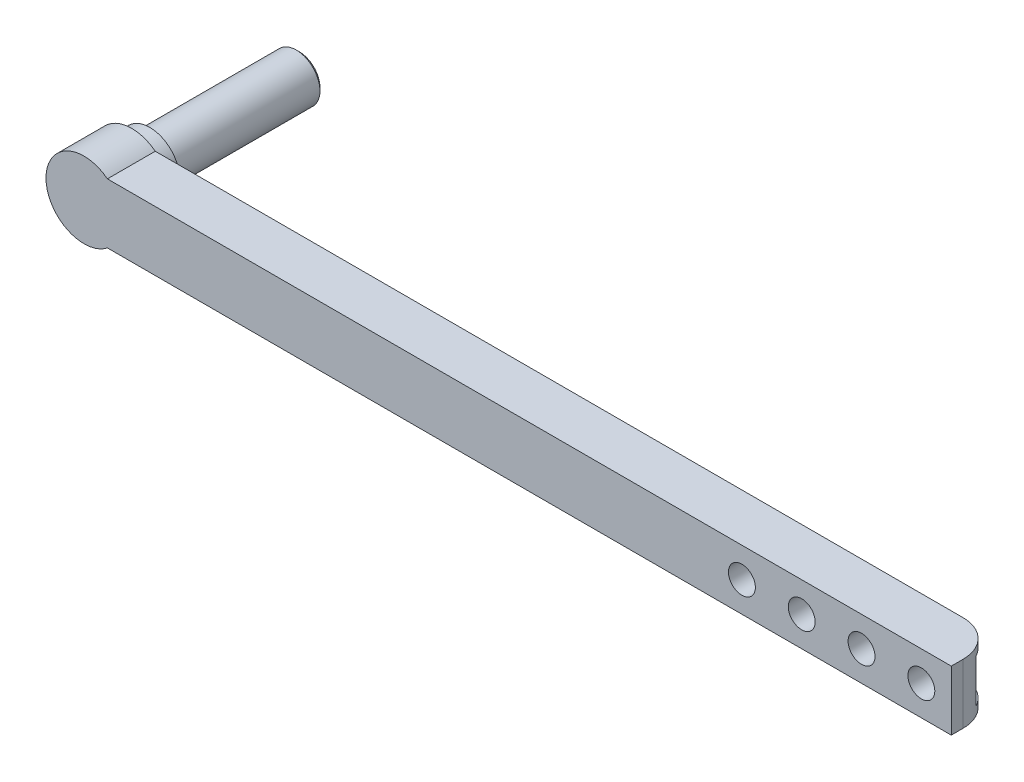
ISO-10303-21;
HEADER;
FILE_DESCRIPTION(('STEP AP214'),'2;1');
FILE_NAME('part.step','',(''),(''),'','','');
FILE_SCHEMA(('AUTOMOTIVE_DESIGN { 1 0 10303 214 1 1 1 1 }'));
ENDSEC;
DATA;
#1=APPLICATION_CONTEXT('core data for automotive mechanical design processes');
#2=APPLICATION_PROTOCOL_DEFINITION('international standard','automotive_design',2000,#1);
#3=PRODUCT_CONTEXT('',#1,'mechanical');
#4=PRODUCT('Part','Part','',(#3));
#5=PRODUCT_RELATED_PRODUCT_CATEGORY('part','',(#4));
#6=PRODUCT_DEFINITION_FORMATION('','',#4);
#7=PRODUCT_DEFINITION_CONTEXT('part definition',#1,'design');
#8=PRODUCT_DEFINITION('design','',#6,#7);
#9=PRODUCT_DEFINITION_SHAPE('','',#8);
#10=(LENGTH_UNIT() NAMED_UNIT(*) SI_UNIT(.MILLI.,.METRE.));
#11=(NAMED_UNIT(*) PLANE_ANGLE_UNIT() SI_UNIT($,.RADIAN.));
#12=(NAMED_UNIT(*) SI_UNIT($,.STERADIAN.) SOLID_ANGLE_UNIT());
#13=UNCERTAINTY_MEASURE_WITH_UNIT(LENGTH_MEASURE(1.E-05),#10,'distance_accuracy_value','');
#14=(GEOMETRIC_REPRESENTATION_CONTEXT(3) GLOBAL_UNCERTAINTY_ASSIGNED_CONTEXT((#13)) GLOBAL_UNIT_ASSIGNED_CONTEXT((#10,
#11,#12)) REPRESENTATION_CONTEXT('',''));
#15=CARTESIAN_POINT('',(0.,0.,0.));
#16=DIRECTION('',(0.,0.,1.));
#17=DIRECTION('',(1.,0.,0.));
#18=AXIS2_PLACEMENT_3D('',#15,#16,#17);
#19=CARTESIAN_POINT('',(0.,0.,8.));
#20=DIRECTION('',(0.,0.,-1.));
#21=DIRECTION('',(-1.,0.,0.));
#22=AXIS2_PLACEMENT_3D('',#19,#20,#21);
#23=CYLINDRICAL_SURFACE('',#22,6.35);
#24=CARTESIAN_POINT('',(0.,0.,0.));
#25=DIRECTION('',(0.,0.,1.));
#26=DIRECTION('',(1.,0.,0.));
#27=AXIS2_PLACEMENT_3D('',#24,#25,#26);
#28=CIRCLE('',#27,6.35);
#29=CARTESIAN_POINT('',(3.91439650520997,5.,0.));
#30=VERTEX_POINT('',#29);
#31=CARTESIAN_POINT('',(3.91439650520997,-5.,0.));
#32=VERTEX_POINT('',#31);
#33=EDGE_CURVE('E141',#30,#32,#28,.T.);
#34=ORIENTED_EDGE('',*,*,#33,.T.);
#35=DIRECTION('',(0.,0.,-1.));
#36=VECTOR('',#35,1.);
#37=CARTESIAN_POINT('',(3.91439650520997,-5.,8.));
#38=LINE('',#37,#36);
#39=CARTESIAN_POINT('',(3.91439650520997,-5.,8.));
#40=VERTEX_POINT('',#39);
#41=EDGE_CURVE('E139',#40,#32,#38,.T.);
#42=ORIENTED_EDGE('',*,*,#41,.F.);
#43=CARTESIAN_POINT('',(0.,0.,8.));
#44=DIRECTION('',(0.,0.,1.));
#45=DIRECTION('',(1.,0.,0.));
#46=AXIS2_PLACEMENT_3D('',#43,#44,#45);
#47=CIRCLE('',#46,6.35);
#48=CARTESIAN_POINT('',(3.91439650520997,5.,8.));
#49=VERTEX_POINT('',#48);
#50=EDGE_CURVE('E123',#49,#40,#47,.T.);
#51=ORIENTED_EDGE('',*,*,#50,.F.);
#52=DIRECTION('',(0.,0.,-1.));
#53=VECTOR('',#52,1.);
#54=CARTESIAN_POINT('',(3.91439650520997,5.,8.));
#55=LINE('',#54,#53);
#56=EDGE_CURVE('E156',#49,#30,#55,.T.);
#57=ORIENTED_EDGE('',*,*,#56,.T.);
#58=EDGE_LOOP('',(#34,#42,#51,#57));
#59=FACE_BOUND('',#58,.T.);
#60=ADVANCED_FACE('F45',(#59),#23,.T.);
#61=CARTESIAN_POINT('',(0.,-5.,8.));
#62=DIRECTION('',(0.,-1.,0.));
#63=DIRECTION('',(0.,0.,-1.));
#64=AXIS2_PLACEMENT_3D('',#61,#62,#63);
#65=PLANE('',#64);
#66=DIRECTION('',(-1.,0.,0.));
#67=VECTOR('',#66,1.);
#68=CARTESIAN_POINT('',(0.,-5.,0.));
#69=LINE('',#68,#67);
#70=CARTESIAN_POINT('',(139.,-5.,0.));
#71=VERTEX_POINT('',#70);
#72=EDGE_CURVE('E158',#71,#32,#69,.T.);
#73=ORIENTED_EDGE('',*,*,#72,.F.);
#74=CARTESIAN_POINT('',(139.,-5.,6.));
#75=DIRECTION('',(0.,-1.,0.));
#76=DIRECTION('',(0.,0.,-1.));
#77=AXIS2_PLACEMENT_3D('',#74,#75,#76);
#78=CIRCLE('',#77,6.);
#79=CARTESIAN_POINT('',(145.,-5.,6.));
#80=VERTEX_POINT('',#79);
#81=EDGE_CURVE('E209',#71,#80,#78,.T.);
#82=ORIENTED_EDGE('',*,*,#81,.T.);
#83=DIRECTION('',(0.,0.,-1.));
#84=VECTOR('',#83,1.);
#85=CARTESIAN_POINT('',(145.,-5.,8.));
#86=LINE('',#85,#84);
#87=CARTESIAN_POINT('',(145.,-5.,8.));
#88=VERTEX_POINT('',#87);
#89=EDGE_CURVE('E145',#88,#80,#86,.T.);
#90=ORIENTED_EDGE('',*,*,#89,.F.);
#91=DIRECTION('',(-1.,0.,0.));
#92=VECTOR('',#91,1.);
#93=CARTESIAN_POINT('',(0.,-5.,8.));
#94=LINE('',#93,#92);
#95=EDGE_CURVE('E128',#88,#40,#94,.T.);
#96=ORIENTED_EDGE('',*,*,#95,.T.);
#97=ORIENTED_EDGE('',*,*,#41,.T.);
#98=EDGE_LOOP('',(#73,#82,#90,#96,#97));
#99=FACE_BOUND('',#98,.T.);
#100=ADVANCED_FACE('F147',(#99),#65,.T.);
#101=CARTESIAN_POINT('',(145.,0.,8.));
#102=DIRECTION('',(1.,0.,0.));
#103=DIRECTION('',(0.,0.,-1.));
#104=AXIS2_PLACEMENT_3D('',#101,#102,#103);
#105=PLANE('',#104);
#106=ORIENTED_EDGE('',*,*,#89,.T.);
#107=DIRECTION('',(0.,-1.,0.));
#108=VECTOR('',#107,1.);
#109=CARTESIAN_POINT('',(145.,5.,6.));
#110=LINE('',#109,#108);
#111=CARTESIAN_POINT('',(145.,5.,6.));
#112=VERTEX_POINT('',#111);
#113=EDGE_CURVE('E211',#80,#112,#110,.F.);
#114=ORIENTED_EDGE('',*,*,#113,.T.);
#115=DIRECTION('',(0.,0.,-1.));
#116=VECTOR('',#115,1.);
#117=CARTESIAN_POINT('',(145.,5.,8.));
#118=LINE('',#117,#116);
#119=CARTESIAN_POINT('',(145.,5.,8.));
#120=VERTEX_POINT('',#119);
#121=EDGE_CURVE('E163',#120,#112,#118,.T.);
#122=ORIENTED_EDGE('',*,*,#121,.F.);
#123=DIRECTION('',(0.,-1.,0.));
#124=VECTOR('',#123,1.);
#125=CARTESIAN_POINT('',(145.,0.,8.));
#126=LINE('',#125,#124);
#127=EDGE_CURVE('E150',#120,#88,#126,.T.);
#128=ORIENTED_EDGE('',*,*,#127,.T.);
#129=EDGE_LOOP('',(#106,#114,#122,#128));
#130=FACE_BOUND('',#129,.T.);
#131=ADVANCED_FACE('F232',(#130),#105,.T.);
#132=CARTESIAN_POINT('',(0.,5.,8.));
#133=DIRECTION('',(0.,-1.,0.));
#134=DIRECTION('',(0.,0.,-1.));
#135=AXIS2_PLACEMENT_3D('',#132,#133,#134);
#136=PLANE('',#135);
#137=ORIENTED_EDGE('',*,*,#121,.T.);
#138=CARTESIAN_POINT('',(139.,5.,6.));
#139=DIRECTION('',(0.,-1.,0.));
#140=DIRECTION('',(0.,0.,-1.));
#141=AXIS2_PLACEMENT_3D('',#138,#139,#140);
#142=CIRCLE('',#141,6.);
#143=CARTESIAN_POINT('',(139.,5.,0.));
#144=VERTEX_POINT('',#143);
#145=EDGE_CURVE('E11',#112,#144,#142,.F.);
#146=ORIENTED_EDGE('',*,*,#145,.T.);
#147=DIRECTION('',(-1.,0.,0.));
#148=VECTOR('',#147,1.);
#149=CARTESIAN_POINT('',(0.,5.,0.));
#150=LINE('',#149,#148);
#151=EDGE_CURVE('E135',#144,#30,#150,.T.);
#152=ORIENTED_EDGE('',*,*,#151,.T.);
#153=ORIENTED_EDGE('',*,*,#56,.F.);
#154=DIRECTION('',(-1.,0.,0.));
#155=VECTOR('',#154,1.);
#156=CARTESIAN_POINT('',(0.,5.,8.));
#157=LINE('',#156,#155);
#158=EDGE_CURVE('E131',#120,#49,#157,.T.);
#159=ORIENTED_EDGE('',*,*,#158,.F.);
#160=EDGE_LOOP('',(#137,#146,#152,#153,#159));
#161=FACE_BOUND('',#160,.T.);
#162=ADVANCED_FACE('F234',(#161),#136,.F.);
#163=CARTESIAN_POINT('',(0.,0.,8.));
#164=DIRECTION('',(0.,0.,1.));
#165=DIRECTION('',(1.,0.,0.));
#166=AXIS2_PLACEMENT_3D('',#163,#164,#165);
#167=PLANE('',#166);
#168=CARTESIAN_POINT('',(140.,0.,8.));
#169=DIRECTION('',(0.,0.,1.));
#170=DIRECTION('',(1.,0.,0.));
#171=AXIS2_PLACEMENT_3D('',#168,#169,#170);
#172=CIRCLE('',#171,2.25);
#173=CARTESIAN_POINT('',(142.25,0.,8.));
#174=VERTEX_POINT('',#173);
#175=EDGE_CURVE('E182',#174,#174,#172,.T.);
#176=ORIENTED_EDGE('',*,*,#175,.F.);
#177=EDGE_LOOP('',(#176));
#178=FACE_BOUND('',#177,.T.);
#179=CARTESIAN_POINT('',(130.,0.,8.));
#180=DIRECTION('',(0.,0.,1.));
#181=DIRECTION('',(1.,0.,0.));
#182=AXIS2_PLACEMENT_3D('',#179,#180,#181);
#183=CIRCLE('',#182,2.25);
#184=CARTESIAN_POINT('',(132.25,0.,8.));
#185=VERTEX_POINT('',#184);
#186=EDGE_CURVE('E178',#185,#185,#183,.T.);
#187=ORIENTED_EDGE('',*,*,#186,.F.);
#188=EDGE_LOOP('',(#187));
#189=FACE_BOUND('',#188,.T.);
#190=CARTESIAN_POINT('',(120.,0.,8.));
#191=DIRECTION('',(0.,0.,1.));
#192=DIRECTION('',(1.,0.,0.));
#193=AXIS2_PLACEMENT_3D('',#190,#191,#192);
#194=CIRCLE('',#193,2.25);
#195=CARTESIAN_POINT('',(122.25,0.,8.));
#196=VERTEX_POINT('',#195);
#197=EDGE_CURVE('E174',#196,#196,#194,.T.);
#198=ORIENTED_EDGE('',*,*,#197,.F.);
#199=EDGE_LOOP('',(#198));
#200=FACE_BOUND('',#199,.T.);
#201=CARTESIAN_POINT('',(110.,0.,8.));
#202=DIRECTION('',(0.,0.,1.));
#203=DIRECTION('',(1.,0.,0.));
#204=AXIS2_PLACEMENT_3D('',#201,#202,#203);
#205=CIRCLE('',#204,2.25);
#206=CARTESIAN_POINT('',(112.25,0.,8.));
#207=VERTEX_POINT('',#206);
#208=EDGE_CURVE('E173',#207,#207,#205,.T.);
#209=ORIENTED_EDGE('',*,*,#208,.F.);
#210=EDGE_LOOP('',(#209));
#211=FACE_BOUND('',#210,.T.);
#212=ORIENTED_EDGE('',*,*,#50,.T.);
#213=ORIENTED_EDGE('',*,*,#95,.F.);
#214=ORIENTED_EDGE('',*,*,#127,.F.);
#215=ORIENTED_EDGE('',*,*,#158,.T.);
#216=EDGE_LOOP('',(#212,#213,#214,#215));
#217=FACE_BOUND('',#216,.T.);
#218=ADVANCED_FACE('F125',(#178,#189,#200,#211,#217),#167,.T.);
#219=CARTESIAN_POINT('',(0.,0.,0.));
#220=DIRECTION('',(0.,0.,1.));
#221=DIRECTION('',(1.,0.,0.));
#222=AXIS2_PLACEMENT_3D('',#219,#220,#221);
#223=PLANE('',#222);
#224=CARTESIAN_POINT('',(0.,0.,0.));
#225=DIRECTION('',(0.,0.,1.));
#226=DIRECTION('',(1.,0.,0.));
#227=AXIS2_PLACEMENT_3D('',#224,#225,#226);
#228=CIRCLE('',#227,5.);
#229=CARTESIAN_POINT('',(5.,0.,0.));
#230=VERTEX_POINT('',#229);
#231=EDGE_CURVE('E228',#230,#230,#228,.T.);
#232=ORIENTED_EDGE('',*,*,#231,.T.);
#233=EDGE_LOOP('',(#232));
#234=FACE_BOUND('',#233,.T.);
#235=DIRECTION('',(1.,0.,0.));
#236=VECTOR('',#235,1.);
#237=CARTESIAN_POINT('',(103.,-3.625,0.));
#238=LINE('',#237,#236);
#239=CARTESIAN_POINT('',(106.7,-3.625,0.));
#240=VERTEX_POINT('',#239);
#241=CARTESIAN_POINT('',(139.,-3.625,0.));
#242=VERTEX_POINT('',#241);
#243=EDGE_CURVE('E220',#240,#242,#238,.T.);
#244=ORIENTED_EDGE('',*,*,#243,.T.);
#245=DIRECTION('',(0.,-1.,0.));
#246=VECTOR('',#245,1.);
#247=CARTESIAN_POINT('',(139.,-5.,0.));
#248=LINE('',#247,#246);
#249=EDGE_CURVE('E206',#242,#71,#248,.T.);
#250=ORIENTED_EDGE('',*,*,#249,.T.);
#251=ORIENTED_EDGE('',*,*,#72,.T.);
#252=ORIENTED_EDGE('',*,*,#33,.F.);
#253=ORIENTED_EDGE('',*,*,#151,.F.);
#254=DIRECTION('',(0.,-1.,0.));
#255=VECTOR('',#254,1.);
#256=CARTESIAN_POINT('',(139.,3.625,0.));
#257=LINE('',#256,#255);
#258=CARTESIAN_POINT('',(139.,3.625,0.));
#259=VERTEX_POINT('',#258);
#260=EDGE_CURVE('E201',#144,#259,#257,.T.);
#261=ORIENTED_EDGE('',*,*,#260,.T.);
#262=DIRECTION('',(1.,0.,0.));
#263=VECTOR('',#262,1.);
#264=CARTESIAN_POINT('',(103.,3.625,0.));
#265=LINE('',#264,#263);
#266=CARTESIAN_POINT('',(106.7,3.625,0.));
#267=VERTEX_POINT('',#266);
#268=EDGE_CURVE('E238',#267,#259,#265,.T.);
#269=ORIENTED_EDGE('',*,*,#268,.F.);
#270=CARTESIAN_POINT('',(106.7,-0.0749999999999991,0.));
#271=DIRECTION('',(0.,0.,1.));
#272=DIRECTION('',(1.,0.,0.));
#273=AXIS2_PLACEMENT_3D('',#270,#271,#272);
#274=CIRCLE('',#273,3.7);
#275=CARTESIAN_POINT('',(103.000760213233,0.,0.));
#276=VERTEX_POINT('',#275);
#277=EDGE_CURVE('E199',#267,#276,#274,.T.);
#278=ORIENTED_EDGE('',*,*,#277,.T.);
#279=CARTESIAN_POINT('',(106.7,0.0749999999999991,0.));
#280=DIRECTION('',(0.,0.,1.));
#281=DIRECTION('',(1.,0.,0.));
#282=AXIS2_PLACEMENT_3D('',#279,#280,#281);
#283=CIRCLE('',#282,3.7);
#284=EDGE_CURVE('E197',#276,#240,#283,.T.);
#285=ORIENTED_EDGE('',*,*,#284,.T.);
#286=EDGE_LOOP('',(#244,#250,#251,#252,#253,#261,#269,#278,#285));
#287=FACE_BOUND('',#286,.T.);
#288=ADVANCED_FACE('F226',(#234,#287),#223,.F.);
#289=CARTESIAN_POINT('',(0.,0.,-3.));
#290=DIRECTION('',(0.,0.,1.));
#291=DIRECTION('',(1.,0.,0.));
#292=AXIS2_PLACEMENT_3D('',#289,#290,#291);
#293=CYLINDRICAL_SURFACE('',#292,5.);
#294=CARTESIAN_POINT('',(0.,0.,-3.));
#295=DIRECTION('',(0.,0.,1.));
#296=DIRECTION('',(1.,0.,0.));
#297=AXIS2_PLACEMENT_3D('',#294,#295,#296);
#298=CIRCLE('',#297,5.);
#299=CARTESIAN_POINT('',(5.,0.,-3.));
#300=VERTEX_POINT('',#299);
#301=EDGE_CURVE('E169',#300,#300,#298,.T.);
#302=ORIENTED_EDGE('',*,*,#301,.T.);
#303=EDGE_LOOP('',(#302));
#304=FACE_BOUND('',#303,.T.);
#305=ORIENTED_EDGE('',*,*,#231,.F.);
#306=EDGE_LOOP('',(#305));
#307=FACE_BOUND('',#306,.T.);
#308=ADVANCED_FACE('F255',(#304,#307),#293,.T.);
#309=CARTESIAN_POINT('',(0.,0.,-3.));
#310=DIRECTION('',(0.,0.,1.));
#311=DIRECTION('',(1.,0.,0.));
#312=AXIS2_PLACEMENT_3D('',#309,#310,#311);
#313=PLANE('',#312);
#314=CARTESIAN_POINT('',(0.,0.,-3.));
#315=DIRECTION('',(0.,0.,1.));
#316=DIRECTION('',(1.,0.,0.));
#317=AXIS2_PLACEMENT_3D('',#314,#315,#316);
#318=CIRCLE('',#317,3.95);
#319=CARTESIAN_POINT('',(3.95,0.,-3.));
#320=VERTEX_POINT('',#319);
#321=EDGE_CURVE('E159',#320,#320,#318,.F.);
#322=ORIENTED_EDGE('',*,*,#321,.F.);
#323=EDGE_LOOP('',(#322));
#324=FACE_BOUND('',#323,.T.);
#325=ORIENTED_EDGE('',*,*,#301,.F.);
#326=EDGE_LOOP('',(#325));
#327=FACE_BOUND('',#326,.T.);
#328=ADVANCED_FACE('F257',(#324,#327),#313,.F.);
#329=CARTESIAN_POINT('',(0.,0.,-28.));
#330=DIRECTION('',(0.,0.,1.));
#331=DIRECTION('',(1.,0.,0.));
#332=AXIS2_PLACEMENT_3D('',#329,#330,#331);
#333=PLANE('',#332);
#334=CARTESIAN_POINT('',(0.,0.,-28.));
#335=DIRECTION('',(0.,0.,1.));
#336=DIRECTION('',(1.,0.,0.));
#337=AXIS2_PLACEMENT_3D('',#334,#335,#336);
#338=CIRCLE('',#337,3.44999999999998);
#339=CARTESIAN_POINT('',(3.44999999999998,0.,-28.));
#340=VERTEX_POINT('',#339);
#341=EDGE_CURVE('E185',#340,#340,#338,.F.);
#342=ORIENTED_EDGE('',*,*,#341,.T.);
#343=EDGE_LOOP('',(#342));
#344=FACE_BOUND('',#343,.T.);
#345=ADVANCED_FACE('F264',(#344),#333,.F.);
#346=CARTESIAN_POINT('',(0.,0.,-28.));
#347=DIRECTION('',(0.,0.,1.));
#348=DIRECTION('',(1.,0.,0.));
#349=AXIS2_PLACEMENT_3D('',#346,#347,#348);
#350=CYLINDRICAL_SURFACE('',#349,3.95);
#351=CARTESIAN_POINT('',(0.,0.,-27.5));
#352=DIRECTION('',(0.,0.,1.));
#353=DIRECTION('',(1.,0.,0.));
#354=AXIS2_PLACEMENT_3D('',#351,#352,#353);
#355=CIRCLE('',#354,3.95);
#356=CARTESIAN_POINT('',(3.95,0.,-27.5));
#357=VERTEX_POINT('',#356);
#358=EDGE_CURVE('E144',#357,#357,#355,.T.);
#359=CARTESIAN_POINT('',(3.95,0.,-27.5));
#360=CARTESIAN_POINT('',(3.95,0.,-27.2447916666666));
#361=CARTESIAN_POINT('',(3.95,0.,-26.9895833333333));
#362=CARTESIAN_POINT('',(3.95,0.,-26.4791666666666));
#363=CARTESIAN_POINT('',(3.95,0.,-26.2239583333333));
#364=CARTESIAN_POINT('',(3.95,0.,-25.7135416666666));
#365=CARTESIAN_POINT('',(3.95,0.,-25.4583333333333));
#366=CARTESIAN_POINT('',(3.95,0.,-24.9479166666666));
#367=CARTESIAN_POINT('',(3.95,0.,-24.6927083333333));
#368=CARTESIAN_POINT('',(3.95,0.,-24.1822916666666));
#369=CARTESIAN_POINT('',(3.95,0.,-23.9270833333333));
#370=CARTESIAN_POINT('',(3.95,0.,-23.4166666666666));
#371=CARTESIAN_POINT('',(3.95,0.,-23.1614583333333));
#372=CARTESIAN_POINT('',(3.95,0.,-22.6510416666667));
#373=CARTESIAN_POINT('',(3.95,0.,-22.3958333333333));
#374=CARTESIAN_POINT('',(3.95,0.,-21.8854166666667));
#375=CARTESIAN_POINT('',(3.95,0.,-21.6302083333333));
#376=CARTESIAN_POINT('',(3.95,0.,-21.1197916666667));
#377=CARTESIAN_POINT('',(3.95,0.,-20.8645833333333));
#378=CARTESIAN_POINT('',(3.95,0.,-20.3541666666667));
#379=CARTESIAN_POINT('',(3.95,0.,-20.0989583333333));
#380=CARTESIAN_POINT('',(3.95,0.,-19.5885416666667));
#381=CARTESIAN_POINT('',(3.95,0.,-19.3333333333333));
#382=CARTESIAN_POINT('',(3.95,0.,-18.8229166666667));
#383=CARTESIAN_POINT('',(3.95,0.,-18.5677083333333));
#384=CARTESIAN_POINT('',(3.95,0.,-18.0572916666667));
#385=CARTESIAN_POINT('',(3.95,0.,-17.8020833333333));
#386=CARTESIAN_POINT('',(3.95,0.,-17.2916666666667));
#387=CARTESIAN_POINT('',(3.95,0.,-17.0364583333333));
#388=CARTESIAN_POINT('',(3.95,0.,-16.5260416666667));
#389=CARTESIAN_POINT('',(3.95,0.,-16.2708333333333));
#390=CARTESIAN_POINT('',(3.95,0.,-15.7604166666667));
#391=CARTESIAN_POINT('',(3.95,0.,-15.5052083333333));
#392=CARTESIAN_POINT('',(3.95,0.,-14.9947916666667));
#393=CARTESIAN_POINT('',(3.95,0.,-14.7395833333333));
#394=CARTESIAN_POINT('',(3.95,0.,-14.2291666666667));
#395=CARTESIAN_POINT('',(3.95,0.,-13.9739583333333));
#396=CARTESIAN_POINT('',(3.95,0.,-13.4635416666667));
#397=CARTESIAN_POINT('',(3.95,0.,-13.2083333333333));
#398=CARTESIAN_POINT('',(3.95,0.,-12.6979166666667));
#399=CARTESIAN_POINT('',(3.95,0.,-12.4427083333333));
#400=CARTESIAN_POINT('',(3.95,0.,-11.9322916666667));
#401=CARTESIAN_POINT('',(3.95,0.,-11.6770833333333));
#402=CARTESIAN_POINT('',(3.95,0.,-11.1666666666667));
#403=CARTESIAN_POINT('',(3.95,0.,-10.9114583333333));
#404=CARTESIAN_POINT('',(3.95,0.,-10.4010416666667));
#405=CARTESIAN_POINT('',(3.95,0.,-10.1458333333333));
#406=CARTESIAN_POINT('',(3.95,0.,-9.63541666666666));
#407=CARTESIAN_POINT('',(3.95,0.,-9.38020833333333));
#408=CARTESIAN_POINT('',(3.95,0.,-8.86979166666666));
#409=CARTESIAN_POINT('',(3.95,0.,-8.61458333333333));
#410=CARTESIAN_POINT('',(3.95,0.,-8.10416666666667));
#411=CARTESIAN_POINT('',(3.95,0.,-7.84895833333333));
#412=CARTESIAN_POINT('',(3.95,0.,-7.33854166666667));
#413=CARTESIAN_POINT('',(3.95,0.,-7.08333333333333));
#414=CARTESIAN_POINT('',(3.95,0.,-6.57291666666667));
#415=CARTESIAN_POINT('',(3.95,0.,-6.31770833333333));
#416=CARTESIAN_POINT('',(3.95,0.,-5.80729166666666));
#417=CARTESIAN_POINT('',(3.95,0.,-5.55208333333333));
#418=CARTESIAN_POINT('',(3.95,0.,-5.04166666666666));
#419=CARTESIAN_POINT('',(3.95,0.,-4.78645833333333));
#420=CARTESIAN_POINT('',(3.95,0.,-4.27604166666666));
#421=CARTESIAN_POINT('',(3.95,0.,-4.02083333333333));
#422=CARTESIAN_POINT('',(3.95,0.,-3.51041666666667));
#423=CARTESIAN_POINT('',(3.95,0.,-3.25520833333333));
#424=CARTESIAN_POINT('',(3.95,0.,-3.));
#425=B_SPLINE_CURVE_WITH_KNOTS('',3,(#359,#360,#361,#362,#363,#364,#365,#366,#367,#368,#369,
#370,#371,#372,#373,#374,#375,#376,#377,#378,#379,#380,#381,#382,#383,#384,#385,#386,#387,#388,
#389,#390,#391,#392,#393,#394,#395,#396,#397,#398,#399,#400,#401,#402,#403,#404,#405,#406,#407,
#408,#409,#410,#411,#412,#413,#414,#415,#416,#417,#418,#419,#420,#421,#422,#423,#424),
.UNSPECIFIED.,.F.,.F.,(4,2,2,2,2,2,2,2,2,2,2,2,2,2,2,2,2,2,2,2,2,2,2,2,2,2,2,2,2,2,2,2,4),(0.,
0.765625000000002,1.53125,2.296875,3.0625,3.828125,4.59375,5.359375,6.12499999999999,
6.89062499999999,7.65624999999999,8.42187499999999,9.18749999999999,9.95312499999999,10.71875,
11.484375,12.25,13.015625,13.78125,14.546875,15.3125,16.078125,16.84375,17.609375,18.375,
19.140625,19.90625,20.671875,21.4375,22.203125,22.96875,23.734375,24.5),.UNSPECIFIED.);
#426=EDGE_CURVE('BSEAM279',#357,#320,#425,.T.);
#427=ORIENTED_EDGE('',*,*,#358,.T.);
#428=ORIENTED_EDGE('',*,*,#321,.T.);
#429=ORIENTED_EDGE('',*,*,#426,.T.);
#430=ORIENTED_EDGE('',*,*,#426,.F.);
#431=EDGE_LOOP('',(#427,#429,#428,#430));
#432=FACE_BOUND('',#431,.T.);
#433=ADVANCED_FACE('F279',(#432),#350,.T.);
#434=CARTESIAN_POINT('',(103.,-3.625,0.));
#435=DIRECTION('',(0.,-1.,0.));
#436=DIRECTION('',(0.,0.,-1.));
#437=AXIS2_PLACEMENT_3D('',#434,#435,#436);
#438=PLANE('',#437);
#439=DIRECTION('',(1.,0.,0.));
#440=VECTOR('',#439,1.);
#441=CARTESIAN_POINT('',(103.,-3.625,3.2));
#442=LINE('',#441,#440);
#443=CARTESIAN_POINT('',(106.7,-3.625,3.2));
#444=VERTEX_POINT('',#443);
#445=CARTESIAN_POINT('',(144.306599664569,-3.625,3.2));
#446=VERTEX_POINT('',#445);
#447=EDGE_CURVE('E222',#444,#446,#442,.T.);
#448=ORIENTED_EDGE('',*,*,#447,.T.);
#449=CARTESIAN_POINT('',(139.,-3.625,6.));
#450=DIRECTION('',(0.,-1.,0.));
#451=DIRECTION('',(0.,0.,-1.));
#452=AXIS2_PLACEMENT_3D('',#449,#450,#451);
#453=CIRCLE('',#452,6.);
#454=EDGE_CURVE('E214',#446,#242,#453,.F.);
#455=ORIENTED_EDGE('',*,*,#454,.T.);
#456=ORIENTED_EDGE('',*,*,#243,.F.);
#457=DIRECTION('',(0.,0.,-1.));
#458=VECTOR('',#457,1.);
#459=CARTESIAN_POINT('',(106.7,-3.625,3.2));
#460=LINE('',#459,#458);
#461=EDGE_CURVE('E188',#240,#444,#460,.F.);
#462=ORIENTED_EDGE('',*,*,#461,.T.);
#463=EDGE_LOOP('',(#448,#455,#456,#462));
#464=FACE_BOUND('',#463,.T.);
#465=ADVANCED_FACE('F219',(#464),#438,.F.);
#466=CARTESIAN_POINT('',(103.,3.625,3.2));
#467=DIRECTION('',(0.,0.,1.));
#468=DIRECTION('',(0.,-1.,0.));
#469=AXIS2_PLACEMENT_3D('',#466,#467,#468);
#470=PLANE('',#469);
#471=CARTESIAN_POINT('',(140.,0.,3.2));
#472=DIRECTION('',(0.,0.,1.));
#473=DIRECTION('',(0.,-1.,0.));
#474=AXIS2_PLACEMENT_3D('',#471,#472,#473);
#475=CIRCLE('',#474,2.25);
#476=CARTESIAN_POINT('',(140.,-2.25,3.2));
#477=VERTEX_POINT('',#476);
#478=EDGE_CURVE('E179',#477,#477,#475,.T.);
#479=ORIENTED_EDGE('',*,*,#478,.T.);
#480=EDGE_LOOP('',(#479));
#481=FACE_BOUND('',#480,.T.);
#482=CARTESIAN_POINT('',(130.,0.,3.2));
#483=DIRECTION('',(0.,0.,1.));
#484=DIRECTION('',(0.,-1.,0.));
#485=AXIS2_PLACEMENT_3D('',#482,#483,#484);
#486=CIRCLE('',#485,2.25);
#487=CARTESIAN_POINT('',(130.,-2.25,3.2));
#488=VERTEX_POINT('',#487);
#489=EDGE_CURVE('E175',#488,#488,#486,.T.);
#490=ORIENTED_EDGE('',*,*,#489,.T.);
#491=EDGE_LOOP('',(#490));
#492=FACE_BOUND('',#491,.T.);
#493=CARTESIAN_POINT('',(120.,0.,3.2));
#494=DIRECTION('',(0.,0.,1.));
#495=DIRECTION('',(0.,-1.,0.));
#496=AXIS2_PLACEMENT_3D('',#493,#494,#495);
#497=CIRCLE('',#496,2.25);
#498=CARTESIAN_POINT('',(120.,-2.25,3.2));
#499=VERTEX_POINT('',#498);
#500=EDGE_CURVE('E170',#499,#499,#497,.T.);
#501=ORIENTED_EDGE('',*,*,#500,.T.);
#502=EDGE_LOOP('',(#501));
#503=FACE_BOUND('',#502,.T.);
#504=CARTESIAN_POINT('',(110.,0.,3.2));
#505=DIRECTION('',(0.,0.,1.));
#506=DIRECTION('',(0.,-1.,0.));
#507=AXIS2_PLACEMENT_3D('',#504,#505,#506);
#508=CIRCLE('',#507,2.25);
#509=CARTESIAN_POINT('',(110.,-2.25,3.2));
#510=VERTEX_POINT('',#509);
#511=EDGE_CURVE('E243',#510,#510,#508,.T.);
#512=ORIENTED_EDGE('',*,*,#511,.T.);
#513=EDGE_LOOP('',(#512));
#514=FACE_BOUND('',#513,.T.);
#515=DIRECTION('',(0.,1.,0.));
#516=VECTOR('',#515,1.);
#517=CARTESIAN_POINT('',(144.306599664569,3.625,3.2));
#518=LINE('',#517,#516);
#519=CARTESIAN_POINT('',(144.306599664569,3.625,3.2));
#520=VERTEX_POINT('',#519);
#521=EDGE_CURVE('E66',#520,#446,#518,.F.);
#522=ORIENTED_EDGE('',*,*,#521,.T.);
#523=ORIENTED_EDGE('',*,*,#447,.F.);
#524=CARTESIAN_POINT('',(106.7,0.0749999999999991,3.2));
#525=DIRECTION('',(0.,0.,1.));
#526=DIRECTION('',(0.,-1.,0.));
#527=AXIS2_PLACEMENT_3D('',#524,#525,#526);
#528=CIRCLE('',#527,3.7);
#529=CARTESIAN_POINT('',(103.000760213233,0.,3.2));
#530=VERTEX_POINT('',#529);
#531=EDGE_CURVE('E193',#444,#530,#528,.F.);
#532=ORIENTED_EDGE('',*,*,#531,.T.);
#533=CARTESIAN_POINT('',(106.7,-0.075,3.2));
#534=DIRECTION('',(0.,0.,1.));
#535=DIRECTION('',(0.,-1.,0.));
#536=AXIS2_PLACEMENT_3D('',#533,#534,#535);
#537=CIRCLE('',#536,3.7);
#538=CARTESIAN_POINT('',(106.7,3.625,3.2));
#539=VERTEX_POINT('',#538);
#540=EDGE_CURVE('E191',#530,#539,#537,.F.);
#541=ORIENTED_EDGE('',*,*,#540,.T.);
#542=DIRECTION('',(1.,0.,0.));
#543=VECTOR('',#542,1.);
#544=CARTESIAN_POINT('',(103.,3.625,3.2));
#545=LINE('',#544,#543);
#546=EDGE_CURVE('E242',#539,#520,#545,.T.);
#547=ORIENTED_EDGE('',*,*,#546,.T.);
#548=EDGE_LOOP('',(#522,#523,#532,#541,#547));
#549=FACE_BOUND('',#548,.T.);
#550=ADVANCED_FACE('F302',(#481,#492,#503,#514,#549),#470,.F.);
#551=CARTESIAN_POINT('',(103.,3.625,0.));
#552=DIRECTION('',(0.,1.,0.));
#553=DIRECTION('',(0.,0.,1.));
#554=AXIS2_PLACEMENT_3D('',#551,#552,#553);
#555=PLANE('',#554);
#556=ORIENTED_EDGE('',*,*,#268,.T.);
#557=CARTESIAN_POINT('',(139.,3.625,6.));
#558=DIRECTION('',(0.,1.,0.));
#559=DIRECTION('',(0.,0.,1.));
#560=AXIS2_PLACEMENT_3D('',#557,#558,#559);
#561=CIRCLE('',#560,6.);
#562=EDGE_CURVE('E53',#259,#520,#561,.F.);
#563=ORIENTED_EDGE('',*,*,#562,.T.);
#564=ORIENTED_EDGE('',*,*,#546,.F.);
#565=DIRECTION('',(0.,0.,1.));
#566=VECTOR('',#565,1.);
#567=CARTESIAN_POINT('',(106.7,3.625,0.));
#568=LINE('',#567,#566);
#569=EDGE_CURVE('E195',#539,#267,#568,.F.);
#570=ORIENTED_EDGE('',*,*,#569,.T.);
#571=EDGE_LOOP('',(#556,#563,#564,#570));
#572=FACE_BOUND('',#571,.T.);
#573=ADVANCED_FACE('F240',(#572),#555,.F.);
#574=CARTESIAN_POINT('',(110.,0.,8.));
#575=DIRECTION('',(0.,0.,1.));
#576=DIRECTION('',(1.,0.,0.));
#577=AXIS2_PLACEMENT_3D('',#574,#575,#576);
#578=CYLINDRICAL_SURFACE('',#577,2.25);
#579=ORIENTED_EDGE('',*,*,#208,.T.);
#580=EDGE_LOOP('',(#579));
#581=FACE_BOUND('',#580,.T.);
#582=ORIENTED_EDGE('',*,*,#511,.F.);
#583=EDGE_LOOP('',(#582));
#584=FACE_BOUND('',#583,.T.);
#585=ADVANCED_FACE('F323',(#581,#584),#578,.F.);
#586=CARTESIAN_POINT('',(120.,0.,8.));
#587=DIRECTION('',(0.,0.,1.));
#588=DIRECTION('',(1.,0.,0.));
#589=AXIS2_PLACEMENT_3D('',#586,#587,#588);
#590=CYLINDRICAL_SURFACE('',#589,2.25);
#591=ORIENTED_EDGE('',*,*,#197,.T.);
#592=EDGE_LOOP('',(#591));
#593=FACE_BOUND('',#592,.T.);
#594=ORIENTED_EDGE('',*,*,#500,.F.);
#595=EDGE_LOOP('',(#594));
#596=FACE_BOUND('',#595,.T.);
#597=ADVANCED_FACE('F326',(#593,#596),#590,.F.);
#598=CARTESIAN_POINT('',(130.,0.,8.));
#599=DIRECTION('',(0.,0.,1.));
#600=DIRECTION('',(1.,0.,0.));
#601=AXIS2_PLACEMENT_3D('',#598,#599,#600);
#602=CYLINDRICAL_SURFACE('',#601,2.25);
#603=ORIENTED_EDGE('',*,*,#186,.T.);
#604=EDGE_LOOP('',(#603));
#605=FACE_BOUND('',#604,.T.);
#606=ORIENTED_EDGE('',*,*,#489,.F.);
#607=EDGE_LOOP('',(#606));
#608=FACE_BOUND('',#607,.T.);
#609=ADVANCED_FACE('F343',(#605,#608),#602,.F.);
#610=CARTESIAN_POINT('',(140.,0.,8.));
#611=DIRECTION('',(0.,0.,1.));
#612=DIRECTION('',(1.,0.,0.));
#613=AXIS2_PLACEMENT_3D('',#610,#611,#612);
#614=CYLINDRICAL_SURFACE('',#613,2.25);
#615=ORIENTED_EDGE('',*,*,#175,.T.);
#616=EDGE_LOOP('',(#615));
#617=FACE_BOUND('',#616,.T.);
#618=ORIENTED_EDGE('',*,*,#478,.F.);
#619=EDGE_LOOP('',(#618));
#620=FACE_BOUND('',#619,.T.);
#621=ADVANCED_FACE('F291',(#617,#620),#614,.F.);
#622=CARTESIAN_POINT('',(0.,0.,-27.5));
#623=DIRECTION('',(0.,0.,1.));
#624=DIRECTION('',(1.,0.,0.));
#625=AXIS2_PLACEMENT_3D('',#622,#623,#624);
#626=CONICAL_SURFACE('',#625,3.95,0.785398163397447);
#627=ORIENTED_EDGE('',*,*,#341,.F.);
#628=EDGE_LOOP('',(#627));
#629=FACE_BOUND('',#628,.T.);
#630=ORIENTED_EDGE('',*,*,#358,.F.);
#631=EDGE_LOOP('',(#630));
#632=FACE_BOUND('',#631,.T.);
#633=ADVANCED_FACE('F285',(#629,#632),#626,.T.);
#634=CARTESIAN_POINT('',(106.7,-0.0749999999999991,0.));
#635=DIRECTION('',(0.,0.,-1.));
#636=DIRECTION('',(0.,1.,0.));
#637=AXIS2_PLACEMENT_3D('',#634,#635,#636);
#638=CYLINDRICAL_SURFACE('',#637,3.7);
#639=ORIENTED_EDGE('',*,*,#569,.F.);
#640=ORIENTED_EDGE('',*,*,#540,.F.);
#641=DIRECTION('',(0.,0.,1.));
#642=VECTOR('',#641,1.);
#643=CARTESIAN_POINT('',(103.000760213233,0.,1.6));
#644=LINE('',#643,#642);
#645=EDGE_CURVE('E202',#276,#530,#644,.T.);
#646=ORIENTED_EDGE('',*,*,#645,.F.);
#647=ORIENTED_EDGE('',*,*,#277,.F.);
#648=EDGE_LOOP('',(#639,#640,#646,#647));
#649=FACE_BOUND('',#648,.T.);
#650=ADVANCED_FACE('F290',(#649),#638,.F.);
#651=CARTESIAN_POINT('',(106.7,0.0749999999999991,0.));
#652=DIRECTION('',(0.,0.,1.));
#653=DIRECTION('',(1.,0.,0.));
#654=AXIS2_PLACEMENT_3D('',#651,#652,#653);
#655=CYLINDRICAL_SURFACE('',#654,3.7);
#656=ORIENTED_EDGE('',*,*,#531,.F.);
#657=ORIENTED_EDGE('',*,*,#461,.F.);
#658=ORIENTED_EDGE('',*,*,#284,.F.);
#659=ORIENTED_EDGE('',*,*,#645,.T.);
#660=EDGE_LOOP('',(#656,#657,#658,#659));
#661=FACE_BOUND('',#660,.T.);
#662=ADVANCED_FACE('F293',(#661),#655,.F.);
#663=CARTESIAN_POINT('',(139.,0.,6.));
#664=DIRECTION('',(0.,1.,0.));
#665=DIRECTION('',(0.,0.,1.));
#666=AXIS2_PLACEMENT_3D('',#663,#664,#665);
#667=CYLINDRICAL_SURFACE('',#666,6.);
#668=ORIENTED_EDGE('',*,*,#145,.F.);
#669=ORIENTED_EDGE('',*,*,#113,.F.);
#670=ORIENTED_EDGE('',*,*,#81,.F.);
#671=ORIENTED_EDGE('',*,*,#249,.F.);
#672=ORIENTED_EDGE('',*,*,#454,.F.);
#673=ORIENTED_EDGE('',*,*,#521,.F.);
#674=ORIENTED_EDGE('',*,*,#562,.F.);
#675=ORIENTED_EDGE('',*,*,#260,.F.);
#676=EDGE_LOOP('',(#668,#669,#670,#671,#672,#673,#674,#675));
#677=FACE_BOUND('',#676,.T.);
#678=ADVANCED_FACE('F47',(#677),#667,.T.);
#679=CLOSED_SHELL('',(#60,#100,#131,#162,#218,#288,#308,#328,#345,#433,#465,#550,#573,#585,#597,
#609,#621,#633,#650,#662,#678));
#680=MANIFOLD_SOLID_BREP('B2',#679);
#681=ADVANCED_BREP_SHAPE_REPRESENTATION('',(#18,#680),#14);
#682=SHAPE_DEFINITION_REPRESENTATION(#9,#681);
ENDSEC;
END-ISO-10303-21;
